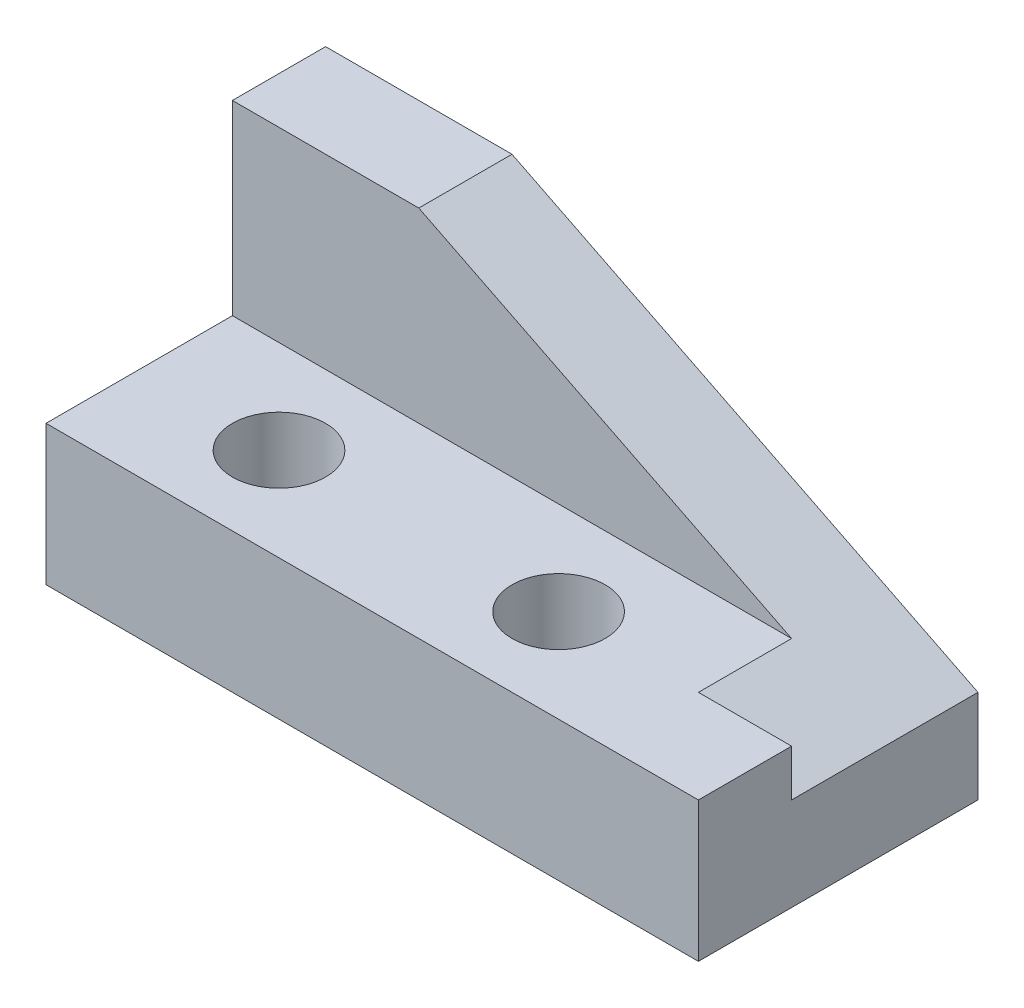
ISO-10303-21;
HEADER;
FILE_DESCRIPTION(('STEP AP214'),'2;1');
FILE_NAME('part.step','',(''),(''),'','','');
FILE_SCHEMA(('AUTOMOTIVE_DESIGN { 1 0 10303 214 1 1 1 1 }'));
ENDSEC;
DATA;
#1=APPLICATION_CONTEXT('core data for automotive mechanical design processes');
#2=APPLICATION_PROTOCOL_DEFINITION('international standard','automotive_design',2000,#1);
#3=PRODUCT_CONTEXT('',#1,'mechanical');
#4=PRODUCT('Part','Part','',(#3));
#5=PRODUCT_RELATED_PRODUCT_CATEGORY('part','',(#4));
#6=PRODUCT_DEFINITION_FORMATION('','',#4);
#7=PRODUCT_DEFINITION_CONTEXT('part definition',#1,'design');
#8=PRODUCT_DEFINITION('design','',#6,#7);
#9=PRODUCT_DEFINITION_SHAPE('','',#8);
#10=(LENGTH_UNIT() NAMED_UNIT(*) SI_UNIT(.MILLI.,.METRE.));
#11=(NAMED_UNIT(*) PLANE_ANGLE_UNIT() SI_UNIT($,.RADIAN.));
#12=(NAMED_UNIT(*) SI_UNIT($,.STERADIAN.) SOLID_ANGLE_UNIT());
#13=UNCERTAINTY_MEASURE_WITH_UNIT(LENGTH_MEASURE(1.E-05),#10,'distance_accuracy_value','');
#14=(GEOMETRIC_REPRESENTATION_CONTEXT(3) GLOBAL_UNCERTAINTY_ASSIGNED_CONTEXT((#13)) GLOBAL_UNIT_ASSIGNED_CONTEXT((#10,
#11,#12)) REPRESENTATION_CONTEXT('',''));
#15=CARTESIAN_POINT('',(0.,0.,0.));
#16=DIRECTION('',(0.,0.,1.));
#17=DIRECTION('',(1.,0.,0.));
#18=AXIS2_PLACEMENT_3D('',#15,#16,#17);
#19=CARTESIAN_POINT('',(0.,35.,0.));
#20=DIRECTION('',(1.,0.,0.));
#21=DIRECTION('',(0.,0.,-1.));
#22=AXIS2_PLACEMENT_3D('',#19,#20,#21);
#23=PLANE('',#22);
#24=DIRECTION('',(0.,-1.,0.));
#25=VECTOR('',#24,1.);
#26=CARTESIAN_POINT('',(0.,35.,0.));
#27=LINE('',#26,#25);
#28=CARTESIAN_POINT('',(0.,15.,0.));
#29=VERTEX_POINT('',#28);
#30=CARTESIAN_POINT('',(0.,0.,0.));
#31=VERTEX_POINT('',#30);
#32=EDGE_CURVE('E123',#29,#31,#27,.T.);
#33=ORIENTED_EDGE('',*,*,#32,.F.);
#34=DIRECTION('',(0.,0.,1.));
#35=VECTOR('',#34,1.);
#36=CARTESIAN_POINT('',(0.,15.,0.));
#37=LINE('',#36,#35);
#38=CARTESIAN_POINT('',(0.,15.,-20.));
#39=VERTEX_POINT('',#38);
#40=EDGE_CURVE('E190',#39,#29,#37,.T.);
#41=ORIENTED_EDGE('',*,*,#40,.F.);
#42=DIRECTION('',(0.,-1.,0.));
#43=VECTOR('',#42,1.);
#44=CARTESIAN_POINT('',(0.,35.,-20.));
#45=LINE('',#44,#43);
#46=CARTESIAN_POINT('',(0.,35.,-20.));
#47=VERTEX_POINT('',#46);
#48=EDGE_CURVE('E200',#47,#39,#45,.T.);
#49=ORIENTED_EDGE('',*,*,#48,.F.);
#50=DIRECTION('',(0.,0.,1.));
#51=VECTOR('',#50,1.);
#52=CARTESIAN_POINT('',(0.,35.,0.));
#53=LINE('',#52,#51);
#54=CARTESIAN_POINT('',(0.,35.,-30.));
#55=VERTEX_POINT('',#54);
#56=EDGE_CURVE('E113',#55,#47,#53,.T.);
#57=ORIENTED_EDGE('',*,*,#56,.F.);
#58=DIRECTION('',(0.,-1.,0.));
#59=VECTOR('',#58,1.);
#60=CARTESIAN_POINT('',(0.,35.,-30.));
#61=LINE('',#60,#59);
#62=CARTESIAN_POINT('',(0.,0.,-30.));
#63=VERTEX_POINT('',#62);
#64=EDGE_CURVE('E95',#55,#63,#61,.T.);
#65=ORIENTED_EDGE('',*,*,#64,.T.);
#66=DIRECTION('',(0.,0.,1.));
#67=VECTOR('',#66,1.);
#68=CARTESIAN_POINT('',(0.,0.,0.));
#69=LINE('',#68,#67);
#70=EDGE_CURVE('E111',#63,#31,#69,.T.);
#71=ORIENTED_EDGE('',*,*,#70,.T.);
#72=EDGE_LOOP('',(#33,#41,#49,#57,#65,#71));
#73=FACE_BOUND('',#72,.T.);
#74=ADVANCED_FACE('F39',(#73),#23,.F.);
#75=CARTESIAN_POINT('',(0.,35.,0.));
#76=DIRECTION('',(0.,0.,-1.));
#77=DIRECTION('',(-1.,0.,0.));
#78=AXIS2_PLACEMENT_3D('',#75,#76,#77);
#79=PLANE('',#78);
#80=DIRECTION('',(0.,-1.,0.));
#81=VECTOR('',#80,1.);
#82=CARTESIAN_POINT('',(70.,35.,0.));
#83=LINE('',#82,#81);
#84=CARTESIAN_POINT('',(70.,15.,0.));
#85=VERTEX_POINT('',#84);
#86=CARTESIAN_POINT('',(70.,0.,0.));
#87=VERTEX_POINT('',#86);
#88=EDGE_CURVE('E94',#85,#87,#83,.T.);
#89=ORIENTED_EDGE('',*,*,#88,.F.);
#90=DIRECTION('',(-1.,0.,0.));
#91=VECTOR('',#90,1.);
#92=CARTESIAN_POINT('',(70.,15.,0.));
#93=LINE('',#92,#91);
#94=EDGE_CURVE('E146',#85,#29,#93,.T.);
#95=ORIENTED_EDGE('',*,*,#94,.T.);
#96=ORIENTED_EDGE('',*,*,#32,.T.);
#97=DIRECTION('',(1.,0.,0.));
#98=VECTOR('',#97,1.);
#99=CARTESIAN_POINT('',(0.,0.,0.));
#100=LINE('',#99,#98);
#101=EDGE_CURVE('E106',#31,#87,#100,.T.);
#102=ORIENTED_EDGE('',*,*,#101,.T.);
#103=EDGE_LOOP('',(#89,#95,#96,#102));
#104=FACE_BOUND('',#103,.T.);
#105=ADVANCED_FACE('F168',(#104),#79,.F.);
#106=CARTESIAN_POINT('',(70.,35.,0.));
#107=DIRECTION('',(-1.,0.,0.));
#108=DIRECTION('',(0.,0.,1.));
#109=AXIS2_PLACEMENT_3D('',#106,#107,#108);
#110=PLANE('',#109);
#111=DIRECTION('',(0.,-1.,0.));
#112=VECTOR('',#111,1.);
#113=CARTESIAN_POINT('',(70.,35.,-10.));
#114=LINE('',#113,#112);
#115=CARTESIAN_POINT('',(70.,15.,-10.));
#116=VERTEX_POINT('',#115);
#117=CARTESIAN_POINT('',(70.,10.,-10.));
#118=VERTEX_POINT('',#117);
#119=EDGE_CURVE('E149',#116,#118,#114,.T.);
#120=ORIENTED_EDGE('',*,*,#119,.F.);
#121=DIRECTION('',(0.,0.,1.));
#122=VECTOR('',#121,1.);
#123=CARTESIAN_POINT('',(70.,15.,0.));
#124=LINE('',#123,#122);
#125=EDGE_CURVE('E54',#116,#85,#124,.T.);
#126=ORIENTED_EDGE('',*,*,#125,.T.);
#127=ORIENTED_EDGE('',*,*,#88,.T.);
#128=DIRECTION('',(0.,0.,-1.));
#129=VECTOR('',#128,1.);
#130=CARTESIAN_POINT('',(70.,0.,0.));
#131=LINE('',#130,#129);
#132=CARTESIAN_POINT('',(70.,0.,-30.));
#133=VERTEX_POINT('',#132);
#134=EDGE_CURVE('E98',#87,#133,#131,.T.);
#135=ORIENTED_EDGE('',*,*,#134,.T.);
#136=DIRECTION('',(0.,-1.,0.));
#137=VECTOR('',#136,1.);
#138=CARTESIAN_POINT('',(70.,35.,-30.));
#139=LINE('',#138,#137);
#140=CARTESIAN_POINT('',(70.,10.,-30.));
#141=VERTEX_POINT('',#140);
#142=EDGE_CURVE('E82',#141,#133,#139,.T.);
#143=ORIENTED_EDGE('',*,*,#142,.F.);
#144=DIRECTION('',(0.,0.,-1.));
#145=VECTOR('',#144,1.);
#146=CARTESIAN_POINT('',(70.,10.,-10.));
#147=LINE('',#146,#145);
#148=EDGE_CURVE('E151',#118,#141,#147,.T.);
#149=ORIENTED_EDGE('',*,*,#148,.F.);
#150=EDGE_LOOP('',(#120,#126,#127,#135,#143,#149));
#151=FACE_BOUND('',#150,.T.);
#152=ADVANCED_FACE('F100',(#151),#110,.F.);
#153=CARTESIAN_POINT('',(0.,35.,-30.));
#154=DIRECTION('',(0.,0.,1.));
#155=DIRECTION('',(1.,0.,0.));
#156=AXIS2_PLACEMENT_3D('',#153,#154,#155);
#157=PLANE('',#156);
#158=DIRECTION('',(-1.,0.,0.));
#159=VECTOR('',#158,1.);
#160=CARTESIAN_POINT('',(0.,35.,-30.));
#161=LINE('',#160,#159);
#162=CARTESIAN_POINT('',(20.,35.,-30.));
#163=VERTEX_POINT('',#162);
#164=EDGE_CURVE('E63',#163,#55,#161,.T.);
#165=ORIENTED_EDGE('',*,*,#164,.F.);
#166=DIRECTION('',(-0.894427190999916,0.447213595499958,0.));
#167=VECTOR('',#166,1.);
#168=CARTESIAN_POINT('',(70.,10.,-30.));
#169=LINE('',#168,#167);
#170=EDGE_CURVE('E90',#141,#163,#169,.T.);
#171=ORIENTED_EDGE('',*,*,#170,.F.);
#172=ORIENTED_EDGE('',*,*,#142,.T.);
#173=DIRECTION('',(-1.,0.,0.));
#174=VECTOR('',#173,1.);
#175=CARTESIAN_POINT('',(0.,0.,-30.));
#176=LINE('',#175,#174);
#177=EDGE_CURVE('E86',#133,#63,#176,.T.);
#178=ORIENTED_EDGE('',*,*,#177,.T.);
#179=ORIENTED_EDGE('',*,*,#64,.F.);
#180=EDGE_LOOP('',(#165,#171,#172,#178,#179));
#181=FACE_BOUND('',#180,.T.);
#182=ADVANCED_FACE('F84',(#181),#157,.F.);
#183=CARTESIAN_POINT('',(0.,35.,0.));
#184=DIRECTION('',(0.,-1.,0.));
#185=DIRECTION('',(0.,0.,-1.));
#186=AXIS2_PLACEMENT_3D('',#183,#184,#185);
#187=PLANE('',#186);
#188=ORIENTED_EDGE('',*,*,#56,.T.);
#189=DIRECTION('',(-1.,0.,0.));
#190=VECTOR('',#189,1.);
#191=CARTESIAN_POINT('',(70.,35.,-20.));
#192=LINE('',#191,#190);
#193=CARTESIAN_POINT('',(20.,35.,-20.));
#194=VERTEX_POINT('',#193);
#195=EDGE_CURVE('E195',#194,#47,#192,.T.);
#196=ORIENTED_EDGE('',*,*,#195,.F.);
#197=DIRECTION('',(0.,0.,-1.));
#198=VECTOR('',#197,1.);
#199=CARTESIAN_POINT('',(20.,35.,-10.));
#200=LINE('',#199,#198);
#201=EDGE_CURVE('E155',#194,#163,#200,.T.);
#202=ORIENTED_EDGE('',*,*,#201,.T.);
#203=ORIENTED_EDGE('',*,*,#164,.T.);
#204=EDGE_LOOP('',(#188,#196,#202,#203));
#205=FACE_BOUND('',#204,.T.);
#206=ADVANCED_FACE('F213',(#205),#187,.F.);
#207=CARTESIAN_POINT('',(0.,0.,0.));
#208=DIRECTION('',(0.,-1.,0.));
#209=DIRECTION('',(0.,0.,-1.));
#210=AXIS2_PLACEMENT_3D('',#207,#208,#209);
#211=PLANE('',#210);
#212=CARTESIAN_POINT('',(45.,0.,-10.));
#213=DIRECTION('',(0.,1.,0.));
#214=DIRECTION('',(0.,0.,1.));
#215=AXIS2_PLACEMENT_3D('',#212,#213,#214);
#216=CIRCLE('',#215,5.);
#217=CARTESIAN_POINT('',(45.,0.,-5.00000000000001));
#218=VERTEX_POINT('',#217);
#219=EDGE_CURVE('E317',#218,#218,#216,.T.);
#220=ORIENTED_EDGE('',*,*,#219,.T.);
#221=EDGE_LOOP('',(#220));
#222=FACE_BOUND('',#221,.T.);
#223=CARTESIAN_POINT('',(15.,0.,-10.));
#224=DIRECTION('',(0.,1.,0.));
#225=DIRECTION('',(0.,0.,1.));
#226=AXIS2_PLACEMENT_3D('',#223,#224,#225);
#227=CIRCLE('',#226,5.);
#228=CARTESIAN_POINT('',(15.,0.,-5.));
#229=VERTEX_POINT('',#228);
#230=EDGE_CURVE('E208',#229,#229,#227,.T.);
#231=ORIENTED_EDGE('',*,*,#230,.T.);
#232=EDGE_LOOP('',(#231));
#233=FACE_BOUND('',#232,.T.);
#234=ORIENTED_EDGE('',*,*,#70,.F.);
#235=ORIENTED_EDGE('',*,*,#177,.F.);
#236=ORIENTED_EDGE('',*,*,#134,.F.);
#237=ORIENTED_EDGE('',*,*,#101,.F.);
#238=EDGE_LOOP('',(#234,#235,#236,#237));
#239=FACE_BOUND('',#238,.T.);
#240=ADVANCED_FACE('F109',(#222,#233,#239),#211,.T.);
#241=CARTESIAN_POINT('',(70.,10.,-10.));
#242=DIRECTION('',(-0.447213595499958,-0.894427190999916,0.));
#243=DIRECTION('',(0.894427190999916,-0.447213595499958,0.));
#244=AXIS2_PLACEMENT_3D('',#241,#242,#243);
#245=PLANE('',#244);
#246=DIRECTION('',(0.894427190999916,-0.447213595499958,0.));
#247=VECTOR('',#246,1.);
#248=CARTESIAN_POINT('',(70.,10.,-20.));
#249=LINE('',#248,#247);
#250=CARTESIAN_POINT('',(60.,15.,-20.));
#251=VERTEX_POINT('',#250);
#252=EDGE_CURVE('E11',#194,#251,#249,.T.);
#253=ORIENTED_EDGE('',*,*,#252,.T.);
#254=DIRECTION('',(0.,0.,1.));
#255=VECTOR('',#254,1.);
#256=CARTESIAN_POINT('',(60.,15.,-10.));
#257=LINE('',#256,#255);
#258=CARTESIAN_POINT('',(60.,15.,-10.));
#259=VERTEX_POINT('',#258);
#260=EDGE_CURVE('E132',#251,#259,#257,.T.);
#261=ORIENTED_EDGE('',*,*,#260,.T.);
#262=DIRECTION('',(-0.894427190999916,0.447213595499958,0.));
#263=VECTOR('',#262,1.);
#264=CARTESIAN_POINT('',(70.,10.,-10.));
#265=LINE('',#264,#263);
#266=EDGE_CURVE('E142',#118,#259,#265,.T.);
#267=ORIENTED_EDGE('',*,*,#266,.F.);
#268=ORIENTED_EDGE('',*,*,#148,.T.);
#269=ORIENTED_EDGE('',*,*,#170,.T.);
#270=ORIENTED_EDGE('',*,*,#201,.F.);
#271=EDGE_LOOP('',(#253,#261,#267,#268,#269,#270));
#272=FACE_BOUND('',#271,.T.);
#273=ADVANCED_FACE('F140',(#272),#245,.F.);
#274=CARTESIAN_POINT('',(0.,0.,-10.));
#275=DIRECTION('',(0.,0.,-1.));
#276=DIRECTION('',(-1.,0.,0.));
#277=AXIS2_PLACEMENT_3D('',#274,#275,#276);
#278=PLANE('',#277);
#279=DIRECTION('',(-1.,0.,0.));
#280=VECTOR('',#279,1.);
#281=CARTESIAN_POINT('',(0.,15.,-10.));
#282=LINE('',#281,#280);
#283=EDGE_CURVE('E47',#116,#259,#282,.T.);
#284=ORIENTED_EDGE('',*,*,#283,.F.);
#285=ORIENTED_EDGE('',*,*,#119,.T.);
#286=ORIENTED_EDGE('',*,*,#266,.T.);
#287=EDGE_LOOP('',(#284,#285,#286));
#288=FACE_BOUND('',#287,.T.);
#289=ADVANCED_FACE('F148',(#288),#278,.T.);
#290=CARTESIAN_POINT('',(70.,35.,-20.));
#291=DIRECTION('',(0.,0.,-1.));
#292=DIRECTION('',(0.,1.,0.));
#293=AXIS2_PLACEMENT_3D('',#290,#291,#292);
#294=PLANE('',#293);
#295=ORIENTED_EDGE('',*,*,#195,.T.);
#296=ORIENTED_EDGE('',*,*,#48,.T.);
#297=DIRECTION('',(-1.,0.,0.));
#298=VECTOR('',#297,1.);
#299=CARTESIAN_POINT('',(70.,15.,-20.));
#300=LINE('',#299,#298);
#301=EDGE_CURVE('E192',#251,#39,#300,.T.);
#302=ORIENTED_EDGE('',*,*,#301,.F.);
#303=ORIENTED_EDGE('',*,*,#252,.F.);
#304=EDGE_LOOP('',(#295,#296,#302,#303));
#305=FACE_BOUND('',#304,.T.);
#306=ADVANCED_FACE('F212',(#305),#294,.F.);
#307=CARTESIAN_POINT('',(70.,15.,0.));
#308=DIRECTION('',(0.,-1.,0.));
#309=DIRECTION('',(0.,0.,-1.));
#310=AXIS2_PLACEMENT_3D('',#307,#308,#309);
#311=PLANE('',#310);
#312=CARTESIAN_POINT('',(45.,15.,-10.));
#313=DIRECTION('',(0.,1.,0.));
#314=DIRECTION('',(0.,0.,1.));
#315=AXIS2_PLACEMENT_3D('',#312,#313,#314);
#316=CIRCLE('',#315,5.);
#317=CARTESIAN_POINT('',(45.,15.,-5.00000000000001));
#318=VERTEX_POINT('',#317);
#319=EDGE_CURVE('E320',#318,#318,#316,.T.);
#320=ORIENTED_EDGE('',*,*,#319,.F.);
#321=EDGE_LOOP('',(#320));
#322=FACE_BOUND('',#321,.T.);
#323=CARTESIAN_POINT('',(15.,15.,-10.));
#324=DIRECTION('',(0.,1.,0.));
#325=DIRECTION('',(0.,0.,1.));
#326=AXIS2_PLACEMENT_3D('',#323,#324,#325);
#327=CIRCLE('',#326,5.);
#328=CARTESIAN_POINT('',(15.,15.,-5.));
#329=VERTEX_POINT('',#328);
#330=EDGE_CURVE('E204',#329,#329,#327,.T.);
#331=ORIENTED_EDGE('',*,*,#330,.F.);
#332=EDGE_LOOP('',(#331));
#333=FACE_BOUND('',#332,.T.);
#334=ORIENTED_EDGE('',*,*,#301,.T.);
#335=ORIENTED_EDGE('',*,*,#40,.T.);
#336=ORIENTED_EDGE('',*,*,#94,.F.);
#337=ORIENTED_EDGE('',*,*,#125,.F.);
#338=ORIENTED_EDGE('',*,*,#283,.T.);
#339=ORIENTED_EDGE('',*,*,#260,.F.);
#340=EDGE_LOOP('',(#334,#335,#336,#337,#338,#339));
#341=FACE_BOUND('',#340,.T.);
#342=ADVANCED_FACE('F130',(#322,#333,#341),#311,.F.);
#343=CARTESIAN_POINT('',(15.,0.,-10.));
#344=DIRECTION('',(0.,1.,0.));
#345=DIRECTION('',(0.,0.,1.));
#346=AXIS2_PLACEMENT_3D('',#343,#344,#345);
#347=CYLINDRICAL_SURFACE('',#346,5.);
#348=ORIENTED_EDGE('',*,*,#230,.F.);
#349=EDGE_LOOP('',(#348));
#350=FACE_BOUND('',#349,.T.);
#351=ORIENTED_EDGE('',*,*,#330,.T.);
#352=EDGE_LOOP('',(#351));
#353=FACE_BOUND('',#352,.T.);
#354=ADVANCED_FACE('F288',(#350,#353),#347,.F.);
#355=CARTESIAN_POINT('',(45.,0.,-10.));
#356=DIRECTION('',(0.,1.,0.));
#357=DIRECTION('',(0.,0.,1.));
#358=AXIS2_PLACEMENT_3D('',#355,#356,#357);
#359=CYLINDRICAL_SURFACE('',#358,5.);
#360=ORIENTED_EDGE('',*,*,#219,.F.);
#361=EDGE_LOOP('',(#360));
#362=FACE_BOUND('',#361,.T.);
#363=ORIENTED_EDGE('',*,*,#319,.T.);
#364=EDGE_LOOP('',(#363));
#365=FACE_BOUND('',#364,.T.);
#366=ADVANCED_FACE('F297',(#362,#365),#359,.F.);
#367=CLOSED_SHELL('',(#74,#105,#152,#182,#206,#240,#273,#289,#306,#342,#354,#366));
#368=MANIFOLD_SOLID_BREP('B2',#367);
#369=ADVANCED_BREP_SHAPE_REPRESENTATION('',(#18,#368),#14);
#370=SHAPE_DEFINITION_REPRESENTATION(#9,#369);
ENDSEC;
END-ISO-10303-21;
